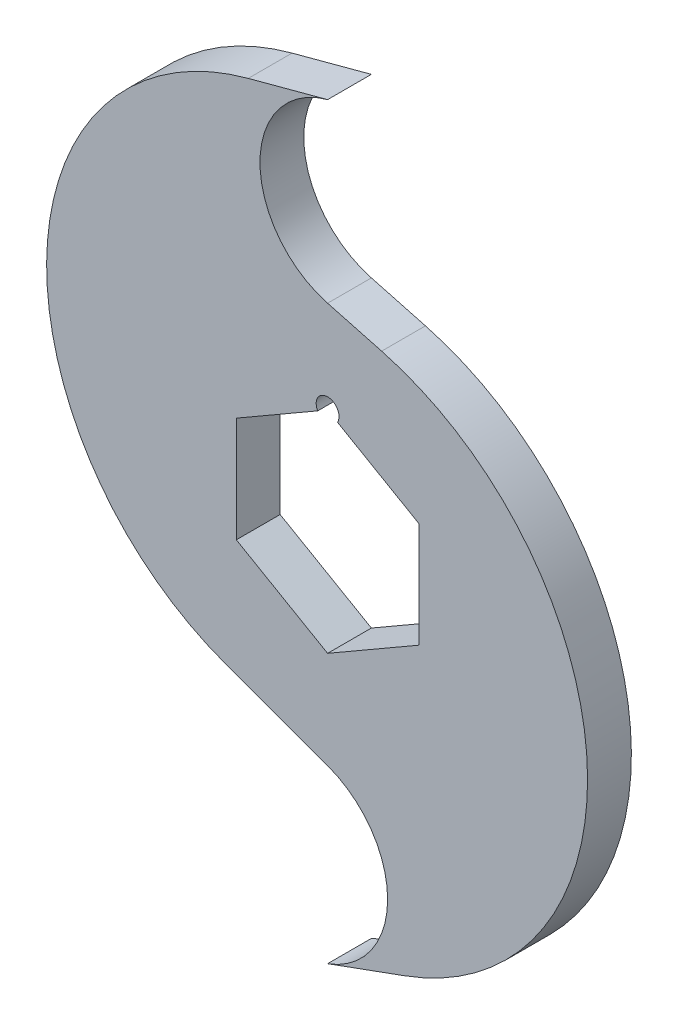
ISO-10303-21;
HEADER;
FILE_DESCRIPTION(('STEP AP214'),'2;1');
FILE_NAME('part.step','',(''),(''),'','','');
FILE_SCHEMA(('AUTOMOTIVE_DESIGN { 1 0 10303 214 1 1 1 1 }'));
ENDSEC;
DATA;
#1=APPLICATION_CONTEXT('core data for automotive mechanical design processes');
#2=APPLICATION_PROTOCOL_DEFINITION('international standard','automotive_design',2000,#1);
#3=PRODUCT_CONTEXT('',#1,'mechanical');
#4=PRODUCT('Part','Part','',(#3));
#5=PRODUCT_RELATED_PRODUCT_CATEGORY('part','',(#4));
#6=PRODUCT_DEFINITION_FORMATION('','',#4);
#7=PRODUCT_DEFINITION_CONTEXT('part definition',#1,'design');
#8=PRODUCT_DEFINITION('design','',#6,#7);
#9=PRODUCT_DEFINITION_SHAPE('','',#8);
#10=(LENGTH_UNIT() NAMED_UNIT(*) SI_UNIT(.MILLI.,.METRE.));
#11=(NAMED_UNIT(*) PLANE_ANGLE_UNIT() SI_UNIT($,.RADIAN.));
#12=(NAMED_UNIT(*) SI_UNIT($,.STERADIAN.) SOLID_ANGLE_UNIT());
#13=UNCERTAINTY_MEASURE_WITH_UNIT(LENGTH_MEASURE(1.E-05),#10,'distance_accuracy_value','');
#14=(GEOMETRIC_REPRESENTATION_CONTEXT(3) GLOBAL_UNCERTAINTY_ASSIGNED_CONTEXT((#13)) GLOBAL_UNIT_ASSIGNED_CONTEXT((#10,
#11,#12)) REPRESENTATION_CONTEXT('',''));
#15=CARTESIAN_POINT('',(0.,0.,0.));
#16=DIRECTION('',(0.,0.,1.));
#17=DIRECTION('',(1.,0.,0.));
#18=AXIS2_PLACEMENT_3D('',#15,#16,#17);
#19=CARTESIAN_POINT('',(-13.0174999999999,48.5819713875279,3.048));
#20=DIRECTION('',(0.258819045102518,-0.965925826289069,0.));
#21=DIRECTION('',(0.965925826289069,0.258819045102518,0.));
#22=AXIS2_PLACEMENT_3D('',#19,#20,#21);
#23=PLANE('',#22);
#24=DIRECTION('',(-0.965925826289069,-0.258819045102518,0.));
#25=VECTOR('',#24,1.);
#26=CARTESIAN_POINT('',(-13.0174999999999,48.5819713875279,-3.048));
#27=LINE('',#26,#25);
#28=CARTESIAN_POINT('',(0.,52.07,-3.048));
#29=VERTEX_POINT('',#28);
#30=CARTESIAN_POINT('',(-11.0405321944841,49.1116983144782,-3.048));
#31=VERTEX_POINT('',#30);
#32=EDGE_CURVE('E200',#29,#31,#27,.T.);
#33=ORIENTED_EDGE('',*,*,#32,.T.);
#34=DIRECTION('',(0.,0.,-1.));
#35=VECTOR('',#34,1.);
#36=CARTESIAN_POINT('',(-11.0405321944841,49.1116983144782,3.048));
#37=LINE('',#36,#35);
#38=CARTESIAN_POINT('',(-11.0405321944841,49.1116983144782,3.048));
#39=VERTEX_POINT('',#38);
#40=EDGE_CURVE('E11',#39,#31,#37,.T.);
#41=ORIENTED_EDGE('',*,*,#40,.F.);
#42=DIRECTION('',(-0.965925826289069,-0.258819045102518,0.));
#43=VECTOR('',#42,1.);
#44=CARTESIAN_POINT('',(-13.0174999999999,48.5819713875279,3.048));
#45=LINE('',#44,#43);
#46=CARTESIAN_POINT('',(0.,52.07,3.048));
#47=VERTEX_POINT('',#46);
#48=EDGE_CURVE('E274',#47,#39,#45,.T.);
#49=ORIENTED_EDGE('',*,*,#48,.F.);
#50=DIRECTION('',(0.,0.,-1.));
#51=VECTOR('',#50,1.);
#52=CARTESIAN_POINT('',(0.,52.07,3.048));
#53=LINE('',#52,#51);
#54=EDGE_CURVE('E53',#47,#29,#53,.T.);
#55=ORIENTED_EDGE('',*,*,#54,.T.);
#56=EDGE_LOOP('',(#33,#41,#49,#55));
#57=FACE_BOUND('',#56,.T.);
#58=ADVANCED_FACE('F34',(#57),#23,.F.);
#59=CARTESIAN_POINT('',(-1.24139416120389,12.5408173038956,3.048));
#60=DIRECTION('',(0.,0.,-1.));
#61=DIRECTION('',(-1.,0.,0.));
#62=AXIS2_PLACEMENT_3D('',#59,#60,#61);
#63=CYLINDRICAL_SURFACE('',#62,37.8609620068675);
#64=CARTESIAN_POINT('',(-1.24139416120389,12.5408173038956,-3.048));
#65=DIRECTION('',(0.,0.,1.));
#66=DIRECTION('',(1.,0.,0.));
#67=AXIS2_PLACEMENT_3D('',#64,#65,#66);
#68=CIRCLE('',#67,37.8609620068675);
#69=CARTESIAN_POINT('',(-14.1906058132406,-23.0368493098134,-3.048));
#70=VERTEX_POINT('',#69);
#71=EDGE_CURVE('E202',#31,#70,#68,.T.);
#72=ORIENTED_EDGE('',*,*,#71,.T.);
#73=DIRECTION('',(0.,0.,-1.));
#74=VECTOR('',#73,1.);
#75=CARTESIAN_POINT('',(-14.1906058132406,-23.0368493098134,3.048));
#76=LINE('',#75,#74);
#77=CARTESIAN_POINT('',(-14.1906058132406,-23.0368493098134,3.048));
#78=VERTEX_POINT('',#77);
#79=EDGE_CURVE('E44',#78,#70,#76,.T.);
#80=ORIENTED_EDGE('',*,*,#79,.F.);
#81=CARTESIAN_POINT('',(-1.24139416120389,12.5408173038956,3.048));
#82=DIRECTION('',(0.,0.,1.));
#83=DIRECTION('',(1.,0.,0.));
#84=AXIS2_PLACEMENT_3D('',#81,#82,#83);
#85=CIRCLE('',#84,37.8609620068675);
#86=EDGE_CURVE('E276',#39,#78,#85,.T.);
#87=ORIENTED_EDGE('',*,*,#86,.F.);
#88=ORIENTED_EDGE('',*,*,#40,.T.);
#89=EDGE_LOOP('',(#72,#80,#87,#88));
#90=FACE_BOUND('',#89,.T.);
#91=ADVANCED_FACE('F303',(#90),#63,.T.);
#92=CARTESIAN_POINT('',(-9.06388619403997,-24.902822650631,3.048));
#93=DIRECTION('',(-0.342020143325673,-0.939692620785907,0.));
#94=DIRECTION('',(0.939692620785907,-0.342020143325673,0.));
#95=AXIS2_PLACEMENT_3D('',#92,#93,#94);
#96=PLANE('',#95);
#97=DIRECTION('',(-0.939692620785907,0.342020143325673,0.));
#98=VECTOR('',#97,1.);
#99=CARTESIAN_POINT('',(-9.06388619403997,-24.902822650631,-3.048));
#100=LINE('',#99,#98);
#101=CARTESIAN_POINT('',(0.,-28.2018074320379,-3.048));
#102=VERTEX_POINT('',#101);
#103=EDGE_CURVE('E205',#102,#70,#100,.T.);
#104=ORIENTED_EDGE('',*,*,#103,.F.);
#105=DIRECTION('',(0.,0.,-1.));
#106=VECTOR('',#105,1.);
#107=CARTESIAN_POINT('',(0.,-28.2018074320379,3.048));
#108=LINE('',#107,#106);
#109=CARTESIAN_POINT('',(0.,-28.2018074320379,3.048));
#110=VERTEX_POINT('',#109);
#111=EDGE_CURVE('E225',#110,#102,#108,.T.);
#112=ORIENTED_EDGE('',*,*,#111,.F.);
#113=DIRECTION('',(-0.939692620785907,0.342020143325673,0.));
#114=VECTOR('',#113,1.);
#115=CARTESIAN_POINT('',(-9.06388619403997,-24.902822650631,3.048));
#116=LINE('',#115,#114);
#117=EDGE_CURVE('E278',#110,#78,#116,.T.);
#118=ORIENTED_EDGE('',*,*,#117,.T.);
#119=ORIENTED_EDGE('',*,*,#79,.T.);
#120=EDGE_LOOP('',(#104,#112,#118,#119));
#121=FACE_BOUND('',#120,.T.);
#122=ADVANCED_FACE('F290',(#121),#96,.T.);
#123=CARTESIAN_POINT('',(-4.34365582023604,-40.135903716019,3.048));
#124=DIRECTION('',(0.,0.,-1.));
#125=DIRECTION('',(-1.,0.,0.));
#126=AXIS2_PLACEMENT_3D('',#123,#124,#125);
#127=CYLINDRICAL_SURFACE('',#126,12.7);
#128=CARTESIAN_POINT('',(-4.34365582023604,-40.135903716019,-3.048));
#129=DIRECTION('',(0.,0.,1.));
#130=DIRECTION('',(1.,0.,0.));
#131=AXIS2_PLACEMENT_3D('',#128,#129,#130);
#132=CIRCLE('',#131,12.7);
#133=CARTESIAN_POINT('',(0.,-52.07,-3.048));
#134=VERTEX_POINT('',#133);
#135=EDGE_CURVE('E208',#134,#102,#132,.T.);
#136=ORIENTED_EDGE('',*,*,#135,.F.);
#137=DIRECTION('',(0.,0.,-1.));
#138=VECTOR('',#137,1.);
#139=CARTESIAN_POINT('',(0.,-52.07,3.048));
#140=LINE('',#139,#138);
#141=CARTESIAN_POINT('',(0.,-52.07,3.048));
#142=VERTEX_POINT('',#141);
#143=EDGE_CURVE('E223',#142,#134,#140,.T.);
#144=ORIENTED_EDGE('',*,*,#143,.F.);
#145=CARTESIAN_POINT('',(-4.34365582023604,-40.135903716019,3.048));
#146=DIRECTION('',(0.,0.,1.));
#147=DIRECTION('',(1.,0.,0.));
#148=AXIS2_PLACEMENT_3D('',#145,#146,#147);
#149=CIRCLE('',#148,12.7);
#150=EDGE_CURVE('E281',#142,#110,#149,.T.);
#151=ORIENTED_EDGE('',*,*,#150,.T.);
#152=ORIENTED_EDGE('',*,*,#111,.T.);
#153=EDGE_LOOP('',(#136,#144,#151,#152));
#154=FACE_BOUND('',#153,.T.);
#155=ADVANCED_FACE('F285',(#154),#127,.F.);
#156=CARTESIAN_POINT('',(16.7349754181892,-45.9789670766024,3.048));
#157=DIRECTION('',(-0.342020143325673,0.939692620785907,0.));
#158=DIRECTION('',(-0.939692620785907,-0.342020143325673,0.));
#159=AXIS2_PLACEMENT_3D('',#156,#157,#158);
#160=PLANE('',#159);
#161=DIRECTION('',(0.939692620785907,0.342020143325673,0.));
#162=VECTOR('',#161,1.);
#163=CARTESIAN_POINT('',(16.7349754181892,-45.9789670766024,-3.048));
#164=LINE('',#163,#162);
#165=CARTESIAN_POINT('',(10.7406866555829,-48.1607097617875,-3.048));
#166=VERTEX_POINT('',#165);
#167=EDGE_CURVE('E211',#134,#166,#164,.T.);
#168=ORIENTED_EDGE('',*,*,#167,.T.);
#169=DIRECTION('',(0.,0.,-1.));
#170=VECTOR('',#169,1.);
#171=CARTESIAN_POINT('',(10.7406866555829,-48.1607097617875,3.048));
#172=LINE('',#171,#170);
#173=CARTESIAN_POINT('',(10.7406866555829,-48.1607097617875,3.048));
#174=VERTEX_POINT('',#173);
#175=EDGE_CURVE('E170',#174,#166,#172,.T.);
#176=ORIENTED_EDGE('',*,*,#175,.F.);
#177=DIRECTION('',(0.939692620785907,0.342020143325673,0.));
#178=VECTOR('',#177,1.);
#179=CARTESIAN_POINT('',(16.7349754181892,-45.9789670766024,3.048));
#180=LINE('',#179,#178);
#181=EDGE_CURVE('E158',#142,#174,#180,.T.);
#182=ORIENTED_EDGE('',*,*,#181,.F.);
#183=ORIENTED_EDGE('',*,*,#143,.T.);
#184=EDGE_LOOP('',(#168,#176,#182,#183));
#185=FACE_BOUND('',#184,.T.);
#186=ADVANCED_FACE('F293',(#185),#160,.F.);
#187=CARTESIAN_POINT('',(-2.48342826754325,-11.827752618226,3.048));
#188=DIRECTION('',(0.,0.,-1.));
#189=DIRECTION('',(-1.,0.,0.));
#190=AXIS2_PLACEMENT_3D('',#187,#188,#189);
#191=CYLINDRICAL_SURFACE('',#190,38.6647254004982);
#192=CARTESIAN_POINT('',(-2.48342826754325,-11.827752618226,-3.048));
#193=DIRECTION('',(0.,0.,1.));
#194=DIRECTION('',(1.,0.,0.));
#195=AXIS2_PLACEMENT_3D('',#192,#193,#194);
#196=CIRCLE('',#195,38.6647254004982);
#197=CARTESIAN_POINT('',(7.52373903976478,25.5195042124902,-3.048));
#198=VERTEX_POINT('',#197);
#199=EDGE_CURVE('E167',#166,#198,#196,.T.);
#200=ORIENTED_EDGE('',*,*,#199,.T.);
#201=DIRECTION('',(0.,0.,-1.));
#202=VECTOR('',#201,1.);
#203=CARTESIAN_POINT('',(7.52373903976478,25.5195042124902,3.048));
#204=LINE('',#203,#202);
#205=CARTESIAN_POINT('',(7.52373903976478,25.5195042124902,3.048));
#206=VERTEX_POINT('',#205);
#207=EDGE_CURVE('E164',#206,#198,#204,.T.);
#208=ORIENTED_EDGE('',*,*,#207,.F.);
#209=CARTESIAN_POINT('',(-2.48342826754325,-11.827752618226,3.048));
#210=DIRECTION('',(0.,0.,1.));
#211=DIRECTION('',(1.,0.,0.));
#212=AXIS2_PLACEMENT_3D('',#209,#210,#211);
#213=CIRCLE('',#212,38.6647254004982);
#214=EDGE_CURVE('E149',#174,#206,#213,.T.);
#215=ORIENTED_EDGE('',*,*,#214,.F.);
#216=ORIENTED_EDGE('',*,*,#175,.T.);
#217=EDGE_LOOP('',(#200,#208,#215,#216));
#218=FACE_BOUND('',#217,.T.);
#219=ADVANCED_FACE('F165',(#218),#191,.T.);
#220=CARTESIAN_POINT('',(6.88387100306433,25.6909563361866,3.048));
#221=DIRECTION('',(0.258819045102518,0.965925826289069,0.));
#222=DIRECTION('',(-0.965925826289069,0.258819045102518,0.));
#223=AXIS2_PLACEMENT_3D('',#220,#221,#222);
#224=PLANE('',#223);
#225=DIRECTION('',(0.965925826289069,-0.258819045102518,0.));
#226=VECTOR('',#225,1.);
#227=CARTESIAN_POINT('',(6.88387100306433,25.6909563361866,-3.048));
#228=LINE('',#227,#226);
#229=CARTESIAN_POINT('',(0.,27.5354840122576,-3.048));
#230=VERTEX_POINT('',#229);
#231=EDGE_CURVE('E214',#230,#198,#228,.T.);
#232=ORIENTED_EDGE('',*,*,#231,.F.);
#233=DIRECTION('',(0.,0.,-1.));
#234=VECTOR('',#233,1.);
#235=CARTESIAN_POINT('',(0.,27.5354840122576,3.048));
#236=LINE('',#235,#234);
#237=CARTESIAN_POINT('',(0.,27.5354840122576,3.048));
#238=VERTEX_POINT('',#237);
#239=EDGE_CURVE('E100',#238,#230,#236,.T.);
#240=ORIENTED_EDGE('',*,*,#239,.F.);
#241=DIRECTION('',(0.965925826289069,-0.258819045102518,0.));
#242=VECTOR('',#241,1.);
#243=CARTESIAN_POINT('',(6.88387100306433,25.6909563361866,3.048));
#244=LINE('',#243,#242);
#245=EDGE_CURVE('E155',#238,#206,#244,.T.);
#246=ORIENTED_EDGE('',*,*,#245,.T.);
#247=ORIENTED_EDGE('',*,*,#207,.T.);
#248=EDGE_LOOP('',(#232,#240,#246,#247));
#249=FACE_BOUND('',#248,.T.);
#250=ADVANCED_FACE('F172',(#249),#224,.T.);
#251=CARTESIAN_POINT('',(0.,14.6646968374165,3.048));
#252=DIRECTION('',(0.,0.,-1.));
#253=DIRECTION('',(-1.,0.,0.));
#254=AXIS2_PLACEMENT_3D('',#251,#252,#253);
#255=CYLINDRICAL_SURFACE('',#254,1.5875);
#256=CARTESIAN_POINT('',(0.,14.6646968374165,-3.048));
#257=DIRECTION('',(0.,0.,1.));
#258=DIRECTION('',(1.,0.,0.));
#259=AXIS2_PLACEMENT_3D('',#256,#257,#258);
#260=CIRCLE('',#259,1.5875);
#261=CARTESIAN_POINT('',(1.3748153285078,13.8709468374165,-3.048));
#262=VERTEX_POINT('',#261);
#263=CARTESIAN_POINT('',(-1.3748153285078,13.8709468374165,-3.048));
#264=VERTEX_POINT('',#263);
#265=EDGE_CURVE('E179',#262,#264,#260,.T.);
#266=ORIENTED_EDGE('',*,*,#265,.F.);
#267=DIRECTION('',(0.,0.,-1.));
#268=VECTOR('',#267,1.);
#269=CARTESIAN_POINT('',(1.3748153285078,13.8709468374165,3.048));
#270=LINE('',#269,#268);
#271=CARTESIAN_POINT('',(1.3748153285078,13.8709468374165,3.048));
#272=VERTEX_POINT('',#271);
#273=EDGE_CURVE('E38',#272,#262,#270,.T.);
#274=ORIENTED_EDGE('',*,*,#273,.F.);
#275=CARTESIAN_POINT('',(0.,14.6646968374165,3.048));
#276=DIRECTION('',(0.,0.,1.));
#277=DIRECTION('',(1.,0.,0.));
#278=AXIS2_PLACEMENT_3D('',#275,#276,#277);
#279=CIRCLE('',#278,1.5875);
#280=CARTESIAN_POINT('',(-1.3748153285078,13.8709468374165,3.048));
#281=VERTEX_POINT('',#280);
#282=EDGE_CURVE('E219',#272,#281,#279,.T.);
#283=ORIENTED_EDGE('',*,*,#282,.T.);
#284=DIRECTION('',(0.,0.,-1.));
#285=VECTOR('',#284,1.);
#286=CARTESIAN_POINT('',(-1.3748153285078,13.8709468374165,3.048));
#287=LINE('',#286,#285);
#288=EDGE_CURVE('E175',#281,#264,#287,.T.);
#289=ORIENTED_EDGE('',*,*,#288,.T.);
#290=EDGE_LOOP('',(#266,#274,#283,#289));
#291=FACE_BOUND('',#290,.T.);
#292=ADVANCED_FACE('F36',(#291),#255,.F.);
#293=CARTESIAN_POINT('',(6.35,10.9985226280624,3.048));
#294=DIRECTION('',(-0.5,-0.866025403784439,0.));
#295=DIRECTION('',(0.866025403784439,-0.5,0.));
#296=AXIS2_PLACEMENT_3D('',#293,#294,#295);
#297=PLANE('',#296);
#298=DIRECTION('',(-0.866025403784439,0.5,0.));
#299=VECTOR('',#298,1.);
#300=CARTESIAN_POINT('',(6.35,10.9985226280624,-3.048));
#301=LINE('',#300,#299);
#302=CARTESIAN_POINT('',(12.7,7.33234841870826,-3.048));
#303=VERTEX_POINT('',#302);
#304=EDGE_CURVE('E182',#303,#262,#301,.T.);
#305=ORIENTED_EDGE('',*,*,#304,.F.);
#306=DIRECTION('',(0.,0.,-1.));
#307=VECTOR('',#306,1.);
#308=CARTESIAN_POINT('',(12.7,7.33234841870826,3.048));
#309=LINE('',#308,#307);
#310=CARTESIAN_POINT('',(12.7,7.33234841870826,3.048));
#311=VERTEX_POINT('',#310);
#312=EDGE_CURVE('E236',#311,#303,#309,.T.);
#313=ORIENTED_EDGE('',*,*,#312,.F.);
#314=DIRECTION('',(-0.866025403784439,0.5,0.));
#315=VECTOR('',#314,1.);
#316=CARTESIAN_POINT('',(6.35,10.9985226280624,3.048));
#317=LINE('',#316,#315);
#318=EDGE_CURVE('E245',#311,#272,#317,.T.);
#319=ORIENTED_EDGE('',*,*,#318,.T.);
#320=ORIENTED_EDGE('',*,*,#273,.T.);
#321=EDGE_LOOP('',(#305,#313,#319,#320));
#322=FACE_BOUND('',#321,.T.);
#323=ADVANCED_FACE('F243',(#322),#297,.T.);
#324=CARTESIAN_POINT('',(12.7,0.,3.048));
#325=DIRECTION('',(-1.,0.,0.));
#326=DIRECTION('',(0.,-1.,0.));
#327=AXIS2_PLACEMENT_3D('',#324,#325,#326);
#328=PLANE('',#327);
#329=DIRECTION('',(0.,1.,0.));
#330=VECTOR('',#329,1.);
#331=CARTESIAN_POINT('',(12.7,0.,-3.048));
#332=LINE('',#331,#330);
#333=CARTESIAN_POINT('',(12.7,-7.33234841870825,-3.048));
#334=VERTEX_POINT('',#333);
#335=EDGE_CURVE('E185',#334,#303,#332,.T.);
#336=ORIENTED_EDGE('',*,*,#335,.F.);
#337=DIRECTION('',(0.,0.,-1.));
#338=VECTOR('',#337,1.);
#339=CARTESIAN_POINT('',(12.7,-7.33234841870825,3.048));
#340=LINE('',#339,#338);
#341=CARTESIAN_POINT('',(12.7,-7.33234841870825,3.048));
#342=VERTEX_POINT('',#341);
#343=EDGE_CURVE('E235',#342,#334,#340,.T.);
#344=ORIENTED_EDGE('',*,*,#343,.F.);
#345=DIRECTION('',(0.,1.,0.));
#346=VECTOR('',#345,1.);
#347=CARTESIAN_POINT('',(12.7,0.,3.048));
#348=LINE('',#347,#346);
#349=EDGE_CURVE('E253',#342,#311,#348,.T.);
#350=ORIENTED_EDGE('',*,*,#349,.T.);
#351=ORIENTED_EDGE('',*,*,#312,.T.);
#352=EDGE_LOOP('',(#336,#344,#350,#351));
#353=FACE_BOUND('',#352,.T.);
#354=ADVANCED_FACE('F251',(#353),#328,.T.);
#355=CARTESIAN_POINT('',(6.35,-10.9985226280624,3.048));
#356=DIRECTION('',(-0.5,0.866025403784439,0.));
#357=DIRECTION('',(-0.866025403784439,-0.5,0.));
#358=AXIS2_PLACEMENT_3D('',#355,#356,#357);
#359=PLANE('',#358);
#360=DIRECTION('',(0.866025403784439,0.5,0.));
#361=VECTOR('',#360,1.);
#362=CARTESIAN_POINT('',(6.35,-10.9985226280624,-3.048));
#363=LINE('',#362,#361);
#364=CARTESIAN_POINT('',(0.,-14.6646968374165,-3.048));
#365=VERTEX_POINT('',#364);
#366=EDGE_CURVE('E188',#365,#334,#363,.T.);
#367=ORIENTED_EDGE('',*,*,#366,.F.);
#368=DIRECTION('',(0.,0.,-1.));
#369=VECTOR('',#368,1.);
#370=CARTESIAN_POINT('',(0.,-14.6646968374165,3.048));
#371=LINE('',#370,#369);
#372=CARTESIAN_POINT('',(0.,-14.6646968374165,3.048));
#373=VERTEX_POINT('',#372);
#374=EDGE_CURVE('E233',#373,#365,#371,.T.);
#375=ORIENTED_EDGE('',*,*,#374,.F.);
#376=DIRECTION('',(0.866025403784439,0.5,0.));
#377=VECTOR('',#376,1.);
#378=CARTESIAN_POINT('',(6.35,-10.9985226280624,3.048));
#379=LINE('',#378,#377);
#380=EDGE_CURVE('E259',#373,#342,#379,.T.);
#381=ORIENTED_EDGE('',*,*,#380,.T.);
#382=ORIENTED_EDGE('',*,*,#343,.T.);
#383=EDGE_LOOP('',(#367,#375,#381,#382));
#384=FACE_BOUND('',#383,.T.);
#385=ADVANCED_FACE('F262',(#384),#359,.T.);
#386=CARTESIAN_POINT('',(-6.35,-10.9985226280624,3.048));
#387=DIRECTION('',(0.5,0.866025403784439,0.));
#388=DIRECTION('',(-0.866025403784439,0.5,0.));
#389=AXIS2_PLACEMENT_3D('',#386,#387,#388);
#390=PLANE('',#389);
#391=DIRECTION('',(0.866025403784439,-0.5,0.));
#392=VECTOR('',#391,1.);
#393=CARTESIAN_POINT('',(-6.35,-10.9985226280624,-3.048));
#394=LINE('',#393,#392);
#395=CARTESIAN_POINT('',(-12.7,-7.33234841870825,-3.048));
#396=VERTEX_POINT('',#395);
#397=EDGE_CURVE('E191',#396,#365,#394,.T.);
#398=ORIENTED_EDGE('',*,*,#397,.F.);
#399=DIRECTION('',(0.,0.,-1.));
#400=VECTOR('',#399,1.);
#401=CARTESIAN_POINT('',(-12.7,-7.33234841870825,3.048));
#402=LINE('',#401,#400);
#403=CARTESIAN_POINT('',(-12.7,-7.33234841870825,3.048));
#404=VERTEX_POINT('',#403);
#405=EDGE_CURVE('E231',#404,#396,#402,.T.);
#406=ORIENTED_EDGE('',*,*,#405,.F.);
#407=DIRECTION('',(0.866025403784439,-0.5,0.));
#408=VECTOR('',#407,1.);
#409=CARTESIAN_POINT('',(-6.35,-10.9985226280624,3.048));
#410=LINE('',#409,#408);
#411=EDGE_CURVE('E263',#404,#373,#410,.T.);
#412=ORIENTED_EDGE('',*,*,#411,.T.);
#413=ORIENTED_EDGE('',*,*,#374,.T.);
#414=EDGE_LOOP('',(#398,#406,#412,#413));
#415=FACE_BOUND('',#414,.T.);
#416=ADVANCED_FACE('F320',(#415),#390,.T.);
#417=CARTESIAN_POINT('',(-12.7,0.,3.048));
#418=DIRECTION('',(1.,0.,0.));
#419=DIRECTION('',(0.,0.,-1.));
#420=AXIS2_PLACEMENT_3D('',#417,#418,#419);
#421=PLANE('',#420);
#422=DIRECTION('',(0.,-1.,0.));
#423=VECTOR('',#422,1.);
#424=CARTESIAN_POINT('',(-12.7,0.,-3.048));
#425=LINE('',#424,#423);
#426=CARTESIAN_POINT('',(-12.7,7.33234841870826,-3.048));
#427=VERTEX_POINT('',#426);
#428=EDGE_CURVE('E194',#427,#396,#425,.T.);
#429=ORIENTED_EDGE('',*,*,#428,.F.);
#430=DIRECTION('',(0.,0.,-1.));
#431=VECTOR('',#430,1.);
#432=CARTESIAN_POINT('',(-12.7,7.33234841870826,3.048));
#433=LINE('',#432,#431);
#434=CARTESIAN_POINT('',(-12.7,7.33234841870826,3.048));
#435=VERTEX_POINT('',#434);
#436=EDGE_CURVE('E229',#435,#427,#433,.T.);
#437=ORIENTED_EDGE('',*,*,#436,.F.);
#438=DIRECTION('',(0.,-1.,0.));
#439=VECTOR('',#438,1.);
#440=CARTESIAN_POINT('',(-12.7,0.,3.048));
#441=LINE('',#440,#439);
#442=EDGE_CURVE('E265',#435,#404,#441,.T.);
#443=ORIENTED_EDGE('',*,*,#442,.T.);
#444=ORIENTED_EDGE('',*,*,#405,.T.);
#445=EDGE_LOOP('',(#429,#437,#443,#444));
#446=FACE_BOUND('',#445,.T.);
#447=ADVANCED_FACE('F316',(#446),#421,.T.);
#448=CARTESIAN_POINT('',(-6.35,10.9985226280624,3.048));
#449=DIRECTION('',(0.5,-0.866025403784439,0.));
#450=DIRECTION('',(0.866025403784439,0.5,0.));
#451=AXIS2_PLACEMENT_3D('',#448,#449,#450);
#452=PLANE('',#451);
#453=DIRECTION('',(-0.866025403784439,-0.5,0.));
#454=VECTOR('',#453,1.);
#455=CARTESIAN_POINT('',(-6.35,10.9985226280624,-3.048));
#456=LINE('',#455,#454);
#457=EDGE_CURVE('E197',#264,#427,#456,.T.);
#458=ORIENTED_EDGE('',*,*,#457,.F.);
#459=ORIENTED_EDGE('',*,*,#288,.F.);
#460=DIRECTION('',(-0.866025403784439,-0.5,0.));
#461=VECTOR('',#460,1.);
#462=CARTESIAN_POINT('',(-6.35,10.9985226280624,3.048));
#463=LINE('',#462,#461);
#464=EDGE_CURVE('E271',#281,#435,#463,.T.);
#465=ORIENTED_EDGE('',*,*,#464,.T.);
#466=ORIENTED_EDGE('',*,*,#436,.T.);
#467=EDGE_LOOP('',(#458,#459,#465,#466));
#468=FACE_BOUND('',#467,.T.);
#469=ADVANCED_FACE('F312',(#468),#452,.T.);
#470=CARTESIAN_POINT('',(3.28700187280198,39.8027420061288,3.048));
#471=DIRECTION('',(0.,0.,-1.));
#472=DIRECTION('',(-1.,0.,0.));
#473=AXIS2_PLACEMENT_3D('',#470,#471,#472);
#474=CYLINDRICAL_SURFACE('',#473,12.7);
#475=CARTESIAN_POINT('',(3.28700187280198,39.8027420061288,-3.048));
#476=DIRECTION('',(0.,0.,1.));
#477=DIRECTION('',(1.,0.,0.));
#478=AXIS2_PLACEMENT_3D('',#475,#476,#477);
#479=CIRCLE('',#478,12.7);
#480=EDGE_CURVE('E216',#29,#230,#479,.T.);
#481=ORIENTED_EDGE('',*,*,#480,.F.);
#482=ORIENTED_EDGE('',*,*,#54,.F.);
#483=CARTESIAN_POINT('',(3.28700187280198,39.8027420061288,3.048));
#484=DIRECTION('',(0.,0.,1.));
#485=DIRECTION('',(1.,0.,0.));
#486=AXIS2_PLACEMENT_3D('',#483,#484,#485);
#487=CIRCLE('',#486,12.7);
#488=EDGE_CURVE('E173',#47,#238,#487,.T.);
#489=ORIENTED_EDGE('',*,*,#488,.T.);
#490=ORIENTED_EDGE('',*,*,#239,.T.);
#491=EDGE_LOOP('',(#481,#482,#489,#490));
#492=FACE_BOUND('',#491,.T.);
#493=ADVANCED_FACE('F315',(#492),#474,.F.);
#494=CARTESIAN_POINT('',(0.,0.,3.048));
#495=DIRECTION('',(0.,0.,1.));
#496=DIRECTION('',(1.,0.,0.));
#497=AXIS2_PLACEMENT_3D('',#494,#495,#496);
#498=PLANE('',#497);
#499=ORIENTED_EDGE('',*,*,#282,.F.);
#500=ORIENTED_EDGE('',*,*,#318,.F.);
#501=ORIENTED_EDGE('',*,*,#349,.F.);
#502=ORIENTED_EDGE('',*,*,#380,.F.);
#503=ORIENTED_EDGE('',*,*,#411,.F.);
#504=ORIENTED_EDGE('',*,*,#442,.F.);
#505=ORIENTED_EDGE('',*,*,#464,.F.);
#506=EDGE_LOOP('',(#499,#500,#501,#502,#503,#504,#505));
#507=FACE_BOUND('',#506,.T.);
#508=ORIENTED_EDGE('',*,*,#48,.T.);
#509=ORIENTED_EDGE('',*,*,#86,.T.);
#510=ORIENTED_EDGE('',*,*,#117,.F.);
#511=ORIENTED_EDGE('',*,*,#150,.F.);
#512=ORIENTED_EDGE('',*,*,#181,.T.);
#513=ORIENTED_EDGE('',*,*,#214,.T.);
#514=ORIENTED_EDGE('',*,*,#245,.F.);
#515=ORIENTED_EDGE('',*,*,#488,.F.);
#516=EDGE_LOOP('',(#508,#509,#510,#511,#512,#513,#514,#515));
#517=FACE_BOUND('',#516,.T.);
#518=ADVANCED_FACE('F152',(#507,#517),#498,.T.);
#519=CARTESIAN_POINT('',(0.,0.,-3.048));
#520=DIRECTION('',(0.,0.,1.));
#521=DIRECTION('',(1.,0.,0.));
#522=AXIS2_PLACEMENT_3D('',#519,#520,#521);
#523=PLANE('',#522);
#524=ORIENTED_EDGE('',*,*,#265,.T.);
#525=ORIENTED_EDGE('',*,*,#457,.T.);
#526=ORIENTED_EDGE('',*,*,#428,.T.);
#527=ORIENTED_EDGE('',*,*,#397,.T.);
#528=ORIENTED_EDGE('',*,*,#366,.T.);
#529=ORIENTED_EDGE('',*,*,#335,.T.);
#530=ORIENTED_EDGE('',*,*,#304,.T.);
#531=EDGE_LOOP('',(#524,#525,#526,#527,#528,#529,#530));
#532=FACE_BOUND('',#531,.T.);
#533=ORIENTED_EDGE('',*,*,#32,.F.);
#534=ORIENTED_EDGE('',*,*,#480,.T.);
#535=ORIENTED_EDGE('',*,*,#231,.T.);
#536=ORIENTED_EDGE('',*,*,#199,.F.);
#537=ORIENTED_EDGE('',*,*,#167,.F.);
#538=ORIENTED_EDGE('',*,*,#135,.T.);
#539=ORIENTED_EDGE('',*,*,#103,.T.);
#540=ORIENTED_EDGE('',*,*,#71,.F.);
#541=EDGE_LOOP('',(#533,#534,#535,#536,#537,#538,#539,#540));
#542=FACE_BOUND('',#541,.T.);
#543=ADVANCED_FACE('F248',(#532,#542),#523,.F.);
#544=CLOSED_SHELL('',(#58,#91,#122,#155,#186,#219,#250,#292,#323,#354,#385,#416,#447,#469,#493,
#518,#543));
#545=MANIFOLD_SOLID_BREP('B2',#544);
#546=ADVANCED_BREP_SHAPE_REPRESENTATION('',(#18,#545),#14);
#547=SHAPE_DEFINITION_REPRESENTATION(#9,#546);
ENDSEC;
END-ISO-10303-21;
